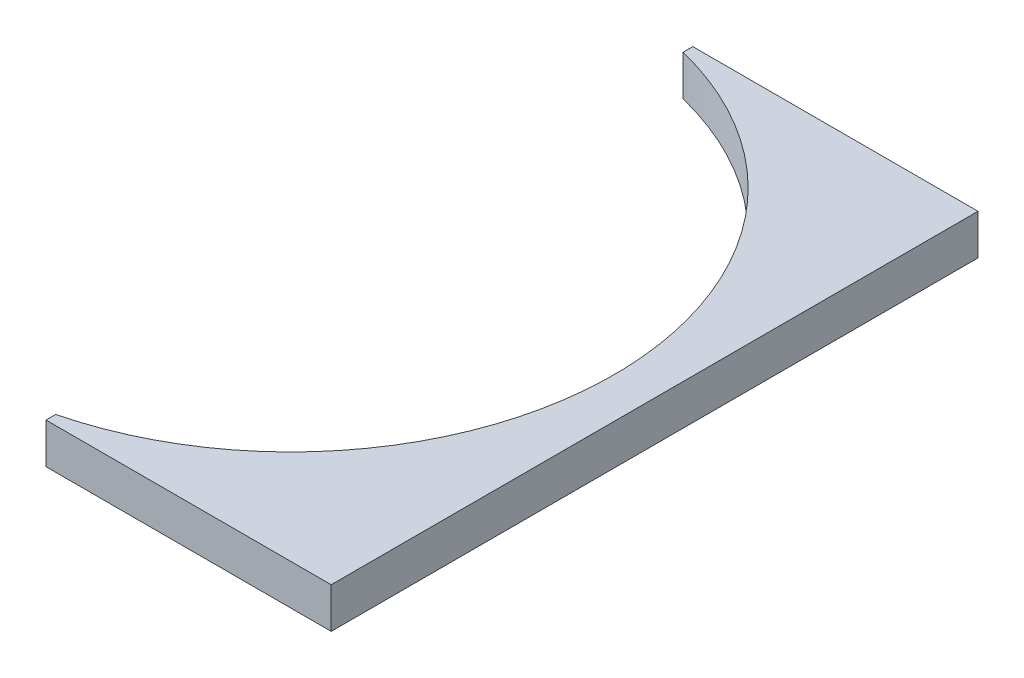
ISO-10303-21;
HEADER;
FILE_DESCRIPTION(('STEP AP214'),'2;1');
FILE_NAME('part.step','',(''),(''),'','','');
FILE_SCHEMA(('AUTOMOTIVE_DESIGN { 1 0 10303 214 1 1 1 1 }'));
ENDSEC;
DATA;
#1=APPLICATION_CONTEXT('core data for automotive mechanical design processes');
#2=APPLICATION_PROTOCOL_DEFINITION('international standard','automotive_design',2000,#1);
#3=PRODUCT_CONTEXT('',#1,'mechanical');
#4=PRODUCT('Part','Part','',(#3));
#5=PRODUCT_RELATED_PRODUCT_CATEGORY('part','',(#4));
#6=PRODUCT_DEFINITION_FORMATION('','',#4);
#7=PRODUCT_DEFINITION_CONTEXT('part definition',#1,'design');
#8=PRODUCT_DEFINITION('design','',#6,#7);
#9=PRODUCT_DEFINITION_SHAPE('','',#8);
#10=(LENGTH_UNIT() NAMED_UNIT(*) SI_UNIT(.MILLI.,.METRE.));
#11=(NAMED_UNIT(*) PLANE_ANGLE_UNIT() SI_UNIT($,.RADIAN.));
#12=(NAMED_UNIT(*) SI_UNIT($,.STERADIAN.) SOLID_ANGLE_UNIT());
#13=UNCERTAINTY_MEASURE_WITH_UNIT(LENGTH_MEASURE(1.E-05),#10,'distance_accuracy_value','');
#14=(GEOMETRIC_REPRESENTATION_CONTEXT(3) GLOBAL_UNCERTAINTY_ASSIGNED_CONTEXT((#13)) GLOBAL_UNIT_ASSIGNED_CONTEXT((#10,
#11,#12)) REPRESENTATION_CONTEXT('',''));
#15=CARTESIAN_POINT('',(0.,0.,0.));
#16=DIRECTION('',(0.,0.,1.));
#17=DIRECTION('',(1.,0.,0.));
#18=AXIS2_PLACEMENT_3D('',#15,#16,#17);
#19=CARTESIAN_POINT('',(0.,3.175,0.));
#20=DIRECTION('',(0.,-1.,0.));
#21=DIRECTION('',(0.,0.,-1.));
#22=AXIS2_PLACEMENT_3D('',#19,#20,#21);
#23=CYLINDRICAL_SURFACE('',#22,25.4);
#24=CARTESIAN_POINT('',(0.,0.,0.));
#25=DIRECTION('',(0.,1.,0.));
#26=DIRECTION('',(0.,0.,1.));
#27=AXIS2_PLACEMENT_3D('',#24,#25,#26);
#28=CIRCLE('',#27,25.4);
#29=CARTESIAN_POINT('',(6.17486485682075,0.,24.638));
#30=VERTEX_POINT('',#29);
#31=CARTESIAN_POINT('',(6.17486485682075,0.,-24.638));
#32=VERTEX_POINT('',#31);
#33=EDGE_CURVE('E117',#30,#32,#28,.T.);
#34=ORIENTED_EDGE('',*,*,#33,.F.);
#35=DIRECTION('',(0.,-1.,0.));
#36=VECTOR('',#35,1.);
#37=CARTESIAN_POINT('',(6.17486485682075,3.175,24.638));
#38=LINE('',#37,#36);
#39=CARTESIAN_POINT('',(6.17486485682075,3.175,24.638));
#40=VERTEX_POINT('',#39);
#41=EDGE_CURVE('E11',#40,#30,#38,.T.);
#42=ORIENTED_EDGE('',*,*,#41,.F.);
#43=CARTESIAN_POINT('',(0.,3.175,0.));
#44=DIRECTION('',(0.,1.,0.));
#45=DIRECTION('',(0.,0.,1.));
#46=AXIS2_PLACEMENT_3D('',#43,#44,#45);
#47=CIRCLE('',#46,25.4);
#48=CARTESIAN_POINT('',(6.17486485682075,3.175,-24.638));
#49=VERTEX_POINT('',#48);
#50=EDGE_CURVE('E131',#40,#49,#47,.T.);
#51=ORIENTED_EDGE('',*,*,#50,.T.);
#52=DIRECTION('',(0.,-1.,0.));
#53=VECTOR('',#52,1.);
#54=CARTESIAN_POINT('',(6.17486485682075,3.175,-24.638));
#55=LINE('',#54,#53);
#56=EDGE_CURVE('E80',#49,#32,#55,.T.);
#57=ORIENTED_EDGE('',*,*,#56,.T.);
#58=EDGE_LOOP('',(#34,#42,#51,#57));
#59=FACE_BOUND('',#58,.T.);
#60=ADVANCED_FACE('F36',(#59),#23,.F.);
#61=CARTESIAN_POINT('',(6.17486485682075,3.175,0.));
#62=DIRECTION('',(-1.,0.,0.));
#63=DIRECTION('',(0.,0.,1.));
#64=AXIS2_PLACEMENT_3D('',#61,#62,#63);
#65=PLANE('',#64);
#66=DIRECTION('',(0.,0.,-1.));
#67=VECTOR('',#66,1.);
#68=CARTESIAN_POINT('',(6.17486485682075,0.,0.));
#69=LINE('',#68,#67);
#70=CARTESIAN_POINT('',(6.17486485682075,0.,25.4));
#71=VERTEX_POINT('',#70);
#72=EDGE_CURVE('E120',#71,#30,#69,.T.);
#73=ORIENTED_EDGE('',*,*,#72,.F.);
#74=DIRECTION('',(0.,-1.,0.));
#75=VECTOR('',#74,1.);
#76=CARTESIAN_POINT('',(6.17486485682075,3.175,25.4));
#77=LINE('',#76,#75);
#78=CARTESIAN_POINT('',(6.17486485682075,3.175,25.4));
#79=VERTEX_POINT('',#78);
#80=EDGE_CURVE('E44',#79,#71,#77,.T.);
#81=ORIENTED_EDGE('',*,*,#80,.F.);
#82=DIRECTION('',(0.,0.,-1.));
#83=VECTOR('',#82,1.);
#84=CARTESIAN_POINT('',(6.17486485682075,3.175,0.));
#85=LINE('',#84,#83);
#86=EDGE_CURVE('E144',#79,#40,#85,.T.);
#87=ORIENTED_EDGE('',*,*,#86,.T.);
#88=ORIENTED_EDGE('',*,*,#41,.T.);
#89=EDGE_LOOP('',(#73,#81,#87,#88));
#90=FACE_BOUND('',#89,.T.);
#91=ADVANCED_FACE('F140',(#90),#65,.T.);
#92=CARTESIAN_POINT('',(0.,3.175,25.4));
#93=DIRECTION('',(0.,0.,1.));
#94=DIRECTION('',(1.,0.,0.));
#95=AXIS2_PLACEMENT_3D('',#92,#93,#94);
#96=PLANE('',#95);
#97=DIRECTION('',(-1.,0.,0.));
#98=VECTOR('',#97,1.);
#99=CARTESIAN_POINT('',(0.,0.,25.4));
#100=LINE('',#99,#98);
#101=CARTESIAN_POINT('',(28.575,0.,25.4));
#102=VERTEX_POINT('',#101);
#103=EDGE_CURVE('E123',#102,#71,#100,.T.);
#104=ORIENTED_EDGE('',*,*,#103,.F.);
#105=DIRECTION('',(0.,-1.,0.));
#106=VECTOR('',#105,1.);
#107=CARTESIAN_POINT('',(28.575,3.175,25.4));
#108=LINE('',#107,#106);
#109=CARTESIAN_POINT('',(28.575,3.175,25.4));
#110=VERTEX_POINT('',#109);
#111=EDGE_CURVE('E103',#110,#102,#108,.T.);
#112=ORIENTED_EDGE('',*,*,#111,.F.);
#113=DIRECTION('',(-1.,0.,0.));
#114=VECTOR('',#113,1.);
#115=CARTESIAN_POINT('',(0.,3.175,25.4));
#116=LINE('',#115,#114);
#117=EDGE_CURVE('E110',#110,#79,#116,.T.);
#118=ORIENTED_EDGE('',*,*,#117,.T.);
#119=ORIENTED_EDGE('',*,*,#80,.T.);
#120=EDGE_LOOP('',(#104,#112,#118,#119));
#121=FACE_BOUND('',#120,.T.);
#122=ADVANCED_FACE('F137',(#121),#96,.T.);
#123=CARTESIAN_POINT('',(28.575,3.175,0.));
#124=DIRECTION('',(1.,0.,0.));
#125=DIRECTION('',(0.,0.,-1.));
#126=AXIS2_PLACEMENT_3D('',#123,#124,#125);
#127=PLANE('',#126);
#128=DIRECTION('',(0.,0.,1.));
#129=VECTOR('',#128,1.);
#130=CARTESIAN_POINT('',(28.575,0.,0.));
#131=LINE('',#130,#129);
#132=CARTESIAN_POINT('',(28.575,0.,-25.4));
#133=VERTEX_POINT('',#132);
#134=EDGE_CURVE('E98',#133,#102,#131,.T.);
#135=ORIENTED_EDGE('',*,*,#134,.F.);
#136=DIRECTION('',(0.,-1.,0.));
#137=VECTOR('',#136,1.);
#138=CARTESIAN_POINT('',(28.575,3.175,-25.4));
#139=LINE('',#138,#137);
#140=CARTESIAN_POINT('',(28.575,3.175,-25.4));
#141=VERTEX_POINT('',#140);
#142=EDGE_CURVE('E93',#141,#133,#139,.T.);
#143=ORIENTED_EDGE('',*,*,#142,.F.);
#144=DIRECTION('',(0.,0.,1.));
#145=VECTOR('',#144,1.);
#146=CARTESIAN_POINT('',(28.575,3.175,0.));
#147=LINE('',#146,#145);
#148=EDGE_CURVE('E96',#141,#110,#147,.T.);
#149=ORIENTED_EDGE('',*,*,#148,.T.);
#150=ORIENTED_EDGE('',*,*,#111,.T.);
#151=EDGE_LOOP('',(#135,#143,#149,#150));
#152=FACE_BOUND('',#151,.T.);
#153=ADVANCED_FACE('F95',(#152),#127,.T.);
#154=CARTESIAN_POINT('',(0.,3.175,-25.4));
#155=DIRECTION('',(0.,0.,-1.));
#156=DIRECTION('',(-1.,0.,0.));
#157=AXIS2_PLACEMENT_3D('',#154,#155,#156);
#158=PLANE('',#157);
#159=DIRECTION('',(1.,0.,0.));
#160=VECTOR('',#159,1.);
#161=CARTESIAN_POINT('',(0.,0.,-25.4));
#162=LINE('',#161,#160);
#163=CARTESIAN_POINT('',(6.17486485682075,0.,-25.4));
#164=VERTEX_POINT('',#163);
#165=EDGE_CURVE('E127',#164,#133,#162,.T.);
#166=ORIENTED_EDGE('',*,*,#165,.F.);
#167=DIRECTION('',(0.,-1.,0.));
#168=VECTOR('',#167,1.);
#169=CARTESIAN_POINT('',(6.17486485682075,3.175,-25.4));
#170=LINE('',#169,#168);
#171=CARTESIAN_POINT('',(6.17486485682075,3.175,-25.4));
#172=VERTEX_POINT('',#171);
#173=EDGE_CURVE('E73',#172,#164,#170,.T.);
#174=ORIENTED_EDGE('',*,*,#173,.F.);
#175=DIRECTION('',(1.,0.,0.));
#176=VECTOR('',#175,1.);
#177=CARTESIAN_POINT('',(0.,3.175,-25.4));
#178=LINE('',#177,#176);
#179=EDGE_CURVE('E107',#172,#141,#178,.T.);
#180=ORIENTED_EDGE('',*,*,#179,.T.);
#181=ORIENTED_EDGE('',*,*,#142,.T.);
#182=EDGE_LOOP('',(#166,#174,#180,#181));
#183=FACE_BOUND('',#182,.T.);
#184=ADVANCED_FACE('F112',(#183),#158,.T.);
#185=CARTESIAN_POINT('',(6.17486485682075,3.175,0.));
#186=DIRECTION('',(1.,0.,0.));
#187=DIRECTION('',(0.,0.,-1.));
#188=AXIS2_PLACEMENT_3D('',#185,#186,#187);
#189=PLANE('',#188);
#190=DIRECTION('',(0.,0.,1.));
#191=VECTOR('',#190,1.);
#192=CARTESIAN_POINT('',(6.17486485682075,0.,0.));
#193=LINE('',#192,#191);
#194=EDGE_CURVE('E129',#164,#32,#193,.T.);
#195=ORIENTED_EDGE('',*,*,#194,.T.);
#196=ORIENTED_EDGE('',*,*,#56,.F.);
#197=DIRECTION('',(0.,0.,1.));
#198=VECTOR('',#197,1.);
#199=CARTESIAN_POINT('',(6.17486485682075,3.175,0.));
#200=LINE('',#199,#198);
#201=EDGE_CURVE('E52',#172,#49,#200,.T.);
#202=ORIENTED_EDGE('',*,*,#201,.F.);
#203=ORIENTED_EDGE('',*,*,#173,.T.);
#204=EDGE_LOOP('',(#195,#196,#202,#203));
#205=FACE_BOUND('',#204,.T.);
#206=ADVANCED_FACE('F143',(#205),#189,.F.);
#207=CARTESIAN_POINT('',(0.,3.175,0.));
#208=DIRECTION('',(0.,1.,0.));
#209=DIRECTION('',(0.,0.,1.));
#210=AXIS2_PLACEMENT_3D('',#207,#208,#209);
#211=PLANE('',#210);
#212=ORIENTED_EDGE('',*,*,#50,.F.);
#213=ORIENTED_EDGE('',*,*,#86,.F.);
#214=ORIENTED_EDGE('',*,*,#117,.F.);
#215=ORIENTED_EDGE('',*,*,#148,.F.);
#216=ORIENTED_EDGE('',*,*,#179,.F.);
#217=ORIENTED_EDGE('',*,*,#201,.T.);
#218=EDGE_LOOP('',(#212,#213,#214,#215,#216,#217));
#219=FACE_BOUND('',#218,.T.);
#220=ADVANCED_FACE('F106',(#219),#211,.T.);
#221=CARTESIAN_POINT('',(0.,0.,0.));
#222=DIRECTION('',(0.,1.,0.));
#223=DIRECTION('',(0.,0.,1.));
#224=AXIS2_PLACEMENT_3D('',#221,#222,#223);
#225=PLANE('',#224);
#226=ORIENTED_EDGE('',*,*,#33,.T.);
#227=ORIENTED_EDGE('',*,*,#194,.F.);
#228=ORIENTED_EDGE('',*,*,#165,.T.);
#229=ORIENTED_EDGE('',*,*,#134,.T.);
#230=ORIENTED_EDGE('',*,*,#103,.T.);
#231=ORIENTED_EDGE('',*,*,#72,.T.);
#232=EDGE_LOOP('',(#226,#227,#228,#229,#230,#231));
#233=FACE_BOUND('',#232,.T.);
#234=ADVANCED_FACE('F142',(#233),#225,.F.);
#235=CLOSED_SHELL('',(#60,#91,#122,#153,#184,#206,#220,#234));
#236=MANIFOLD_SOLID_BREP('B2',#235);
#237=ADVANCED_BREP_SHAPE_REPRESENTATION('',(#18,#236),#14);
#238=SHAPE_DEFINITION_REPRESENTATION(#9,#237);
ENDSEC;
END-ISO-10303-21;
